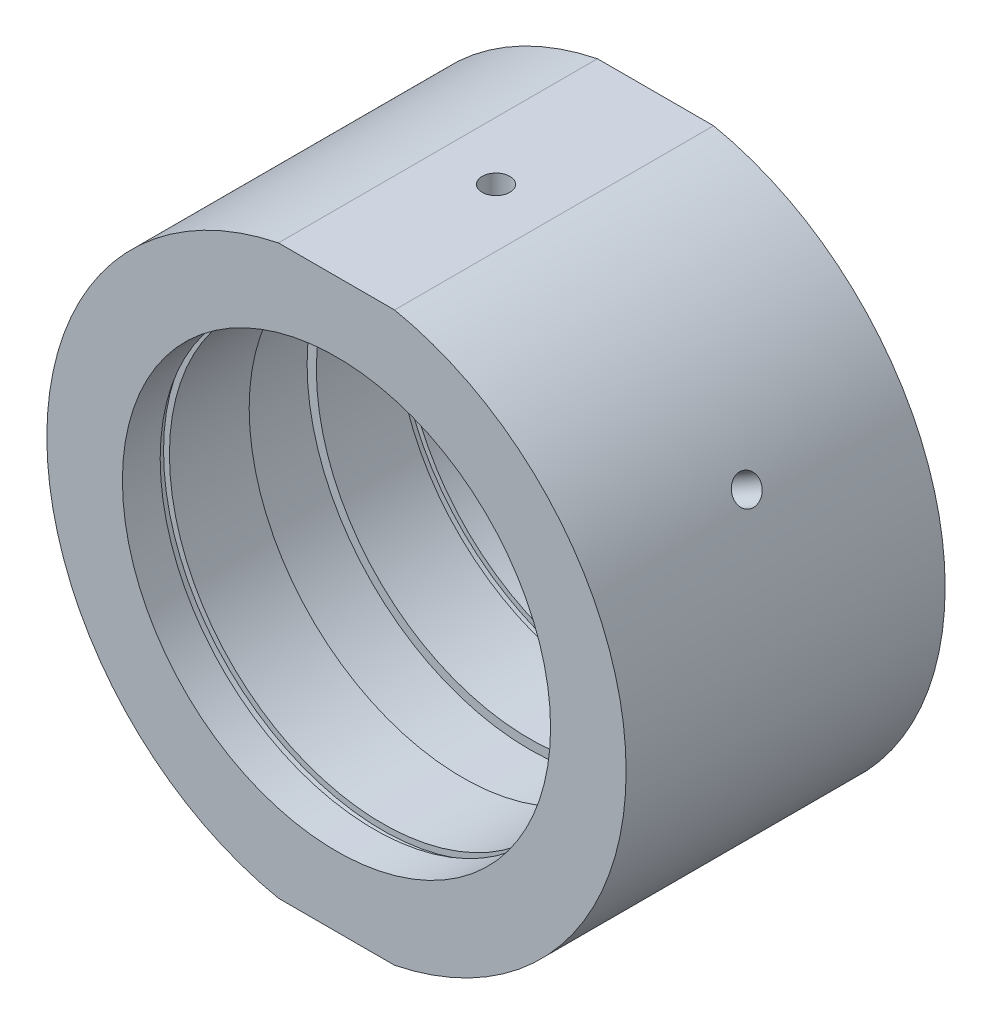
ISO-10303-21;
HEADER;
FILE_DESCRIPTION(('STEP AP214'),'2;1');
FILE_NAME('part.step','',(''),(''),'','','');
FILE_SCHEMA(('AUTOMOTIVE_DESIGN { 1 0 10303 214 1 1 1 1 }'));
ENDSEC;
DATA;
#1=APPLICATION_CONTEXT('core data for automotive mechanical design processes');
#2=APPLICATION_PROTOCOL_DEFINITION('international standard','automotive_design',2000,#1);
#3=PRODUCT_CONTEXT('',#1,'mechanical');
#4=PRODUCT('Part','Part','',(#3));
#5=PRODUCT_RELATED_PRODUCT_CATEGORY('part','',(#4));
#6=PRODUCT_DEFINITION_FORMATION('','',#4);
#7=PRODUCT_DEFINITION_CONTEXT('part definition',#1,'design');
#8=PRODUCT_DEFINITION('design','',#6,#7);
#9=PRODUCT_DEFINITION_SHAPE('','',#8);
#10=(LENGTH_UNIT() NAMED_UNIT(*) SI_UNIT(.MILLI.,.METRE.));
#11=(NAMED_UNIT(*) PLANE_ANGLE_UNIT() SI_UNIT($,.RADIAN.));
#12=(NAMED_UNIT(*) SI_UNIT($,.STERADIAN.) SOLID_ANGLE_UNIT());
#13=UNCERTAINTY_MEASURE_WITH_UNIT(LENGTH_MEASURE(1.E-05),#10,'distance_accuracy_value','');
#14=(GEOMETRIC_REPRESENTATION_CONTEXT(3) GLOBAL_UNCERTAINTY_ASSIGNED_CONTEXT((#13)) GLOBAL_UNIT_ASSIGNED_CONTEXT((#10,
#11,#12)) REPRESENTATION_CONTEXT('',''));
#15=CARTESIAN_POINT('',(0.,0.,0.));
#16=DIRECTION('',(0.,0.,1.));
#17=DIRECTION('',(1.,0.,0.));
#18=AXIS2_PLACEMENT_3D('',#15,#16,#17);
#19=CARTESIAN_POINT('',(0.,0.,-31.9390681003584));
#20=DIRECTION('',(0.,0.,-1.));
#21=DIRECTION('',(-1.,0.,0.));
#22=AXIS2_PLACEMENT_3D('',#19,#20,#21);
#23=CYLINDRICAL_SURFACE('',#22,34.5);
#24=CARTESIAN_POINT('',(29.018686518257,18.659202361171,0.));
#25=CARTESIAN_POINT('',(29.0186890226301,18.6591990847709,-0.0926243427230533));
#26=CARTESIAN_POINT('',(29.0229261660724,18.6526139808489,-0.185314497676535));
#27=CARTESIAN_POINT('',(29.0397421064564,18.6264223952989,-0.368138169659677));
#28=CARTESIAN_POINT('',(29.0523307499622,18.6068005430772,-0.458268537692522));
#29=CARTESIAN_POINT('',(29.0854084283758,18.5550519839002,-0.633297772029717));
#30=CARTESIAN_POINT('',(29.1058934574305,18.5229316173901,-0.718199265666097));
#31=CARTESIAN_POINT('',(29.154053713866,18.4470366758545,-0.880385338206474));
#32=CARTESIAN_POINT('',(29.1817272362996,18.4032648642265,-0.957671717255494));
#33=CARTESIAN_POINT('',(29.2433561506523,18.3051760072346,-1.10252932232191));
#34=CARTESIAN_POINT('',(29.277316671254,18.2508503506647,-1.17009253601071));
#35=CARTESIAN_POINT('',(29.3503804278457,18.1331177240746,-1.29351769255678));
#36=CARTESIAN_POINT('',(29.3894838729624,18.0697103847566,-1.34937915934631));
#37=CARTESIAN_POINT('',(29.4715871030045,17.9354881781567,-1.44783646516308));
#38=CARTESIAN_POINT('',(29.5145886771053,17.8646699070562,-1.49042617247231));
#39=CARTESIAN_POINT('',(29.6031190902553,17.7175816846396,-1.56109160826912));
#40=CARTESIAN_POINT('',(29.648647911373,17.6413117720034,-1.58916743972262));
#41=CARTESIAN_POINT('',(29.740808795372,17.4854932647401,-1.62998728862952));
#42=CARTESIAN_POINT('',(29.7874399787981,17.4059472484999,-1.6427431335627));
#43=CARTESIAN_POINT('',(29.8804691897066,17.2457571173625,-1.65259741342718));
#44=CARTESIAN_POINT('',(29.9268672189013,17.1651130105453,-1.6496959635067));
#45=CARTESIAN_POINT('',(30.018083628711,17.0050913768857,-1.6283278434212));
#46=CARTESIAN_POINT('',(30.0629032703104,16.9257128680339,-1.60987390628149));
#47=CARTESIAN_POINT('',(30.1497956002202,16.770442620803,-1.55794438544301));
#48=CARTESIAN_POINT('',(30.1918682777349,16.6945508961276,-1.52446874271179));
#49=CARTESIAN_POINT('',(30.2722021813879,16.5484360864251,-1.44343152976843));
#50=CARTESIAN_POINT('',(30.3104618277835,16.4782153531619,-1.39586415349126));
#51=CARTESIAN_POINT('',(30.3822123637559,16.3455458494187,-1.28799798254371));
#52=CARTESIAN_POINT('',(30.4157032226793,16.2830971288969,-1.22769910604258));
#53=CARTESIAN_POINT('',(30.4771623434601,16.1677722457299,-1.09600960458675));
#54=CARTESIAN_POINT('',(30.5051250414628,16.114905731566,-1.02460793293809));
#55=CARTESIAN_POINT('',(30.5548550638343,16.0204148604137,-0.872778498215204));
#56=CARTESIAN_POINT('',(30.5766223866588,15.9787905062275,-0.792350732891145));
#57=CARTESIAN_POINT('',(30.6134867225159,15.9080492118723,-0.624745495457385));
#58=CARTESIAN_POINT('',(30.6285835419517,15.8789326347149,-0.537567827532799));
#59=CARTESIAN_POINT('',(30.6517835414348,15.8341026999537,-0.358940446729577));
#60=CARTESIAN_POINT('',(30.6598867696106,15.8183892501122,-0.267490763254709));
#61=CARTESIAN_POINT('',(30.6689247152818,15.8008593470061,-0.0830122772694549));
#62=CARTESIAN_POINT('',(30.6698665258734,15.7990291429491,0.0100148712465112));
#63=CARTESIAN_POINT('',(30.664580676854,15.8092860027456,0.195092849541695));
#64=CARTESIAN_POINT('',(30.658353038901,15.821373024557,0.287143682269393));
#65=CARTESIAN_POINT('',(30.6388634170433,15.8590823818547,0.467612670778403));
#66=CARTESIAN_POINT('',(30.6256046953998,15.8846984401569,0.556032490783883));
#67=CARTESIAN_POINT('',(30.5923358095993,15.9486765040332,0.72678078659425));
#68=CARTESIAN_POINT('',(30.5723256097426,15.987038577004,0.809109230187157));
#69=CARTESIAN_POINT('',(30.5259682580852,16.0753769032314,0.965408887343578));
#70=CARTESIAN_POINT('',(30.4996161301641,16.1253622755297,1.03937347098153));
#71=CARTESIAN_POINT('',(30.4411712398855,16.2354231711368,1.17677914740039));
#72=CARTESIAN_POINT('',(30.4090784437665,16.2954987537871,1.24022017828688));
#73=CARTESIAN_POINT('',(30.3398679677335,16.4239986427153,1.3548297822729));
#74=CARTESIAN_POINT('',(30.3027462394544,16.4924296708247,1.40598837488637));
#75=CARTESIAN_POINT('',(30.2243987545537,16.6355753834692,1.494512673378));
#76=CARTESIAN_POINT('',(30.1831730146581,16.7102900423948,1.53187843546654));
#77=CARTESIAN_POINT('',(30.0976849159111,16.8637798205434,1.5917389330968));
#78=CARTESIAN_POINT('',(30.0534238720324,16.9425531778004,1.6142400640177));
#79=CARTESIAN_POINT('',(29.963030084702,17.1019067894185,1.64375352134685));
#80=CARTESIAN_POINT('',(29.9168973506251,17.1824870347285,1.65076592532464));
#81=CARTESIAN_POINT('',(29.8240946146471,17.3430669653615,1.64910212014318));
#82=CARTESIAN_POINT('',(29.7774251953544,17.4230671501364,1.64044157286201));
#83=CARTESIAN_POINT('',(29.6848591764854,17.5803146476675,1.6077100652785));
#84=CARTESIAN_POINT('',(29.638962578377,17.6575619551951,1.5836390757076));
#85=CARTESIAN_POINT('',(29.5493252013585,17.8071612173229,1.52077310447278));
#86=CARTESIAN_POINT('',(29.5055844419095,17.8795131277338,1.48197798991913));
#87=CARTESIAN_POINT('',(29.4216223362801,18.017343299041,1.39076788234283));
#88=CARTESIAN_POINT('',(29.3814008795705,18.0828217758211,1.33835331726558));
#89=CARTESIAN_POINT('',(29.3057307454963,18.2052007887114,1.22133661715551));
#90=CARTESIAN_POINT('',(29.2702863485369,18.2620936372031,1.15672367477514));
#91=CARTESIAN_POINT('',(29.2053717797418,18.3657292092485,1.01714936462466));
#92=CARTESIAN_POINT('',(29.1759030811655,18.4124694299568,0.942185452546659));
#93=CARTESIAN_POINT('',(29.1239205894126,18.4945835544808,0.783982153805301));
#94=CARTESIAN_POINT('',(29.1014132049216,18.5299469858563,0.700735234302691));
#95=CARTESIAN_POINT('',(29.0641845622712,18.5882862214062,0.528445560311793));
#96=CARTESIAN_POINT('',(29.0494540958738,18.6112766763966,0.439409801080958));
#97=CARTESIAN_POINT('',(29.0321614740973,18.6382333601077,0.291516338342965));
#98=CARTESIAN_POINT('',(29.0271160082175,18.6460874105114,0.233616851804285));
#99=CARTESIAN_POINT('',(29.0203777395267,18.6565729452599,0.117153687562115));
#100=CARTESIAN_POINT('',(29.0186849341027,18.659204433675,0.0585900103763132));
#101=CARTESIAN_POINT('',(29.018686518257,18.659202361171,0.));
#102=B_SPLINE_CURVE_WITH_KNOTS('',3,(#24,#25,#26,#27,#28,#29,#30,#31,#32,#33,#34,#35,#36,#37,
#38,#39,#40,#41,#42,#43,#44,#45,#46,#47,#48,#49,#50,#51,#52,#53,#54,#55,#56,#57,#58,#59,#60,#61,
#62,#63,#64,#65,#66,#67,#68,#69,#70,#71,#72,#73,#74,#75,#76,#77,#78,#79,#80,#81,#82,#83,#84,#85,
#86,#87,#88,#89,#90,#91,#92,#93,#94,#95,#96,#97,#98,#99,#100,#101),.UNSPECIFIED.,.T.,.F.,(4,2,2,
2,2,2,2,2,2,2,2,2,2,2,2,2,2,2,2,2,2,2,2,2,2,2,2,2,2,2,2,2,2,2,2,2,2,2,4),(0.,0.277659154077305,
0.555646256308951,0.83349252028949,1.11127294552115,1.38928097954158,1.6673003216998,
1.94544792246329,2.22359354993492,2.5015243024886,2.77945301106291,3.0571543965571,
3.33485687337425,3.61267392845926,3.89049276924682,4.16858981490659,4.44668692988452,
4.72479211549336,5.00289538721969,5.28072317291099,5.55855011932174,5.8362482730582,
6.11394789519313,6.39186612562733,6.66978599058332,6.94793092956793,7.22607473500656,
7.50409879340258,7.78212145941518,8.05986645258557,8.33761197326971,8.61536000075174,
8.89309930199186,9.17108583548285,9.4491408211698,9.7274510315211,10.0054309661759,
10.1810658470197,10.356700590978),.UNSPECIFIED.);
#103=CARTESIAN_POINT('',(29.018686518257,18.659202361171,0.));
#104=VERTEX_POINT('',#103);
#105=EDGE_CURVE('E11',#104,#104,#102,.T.);
#106=ORIENTED_EDGE('',*,*,#105,.T.);
#107=EDGE_LOOP('',(#106));
#108=FACE_BOUND('',#107,.T.);
#109=CARTESIAN_POINT('',(0.,0.,19.));
#110=DIRECTION('',(0.,0.,-1.));
#111=DIRECTION('',(-1.,0.,0.));
#112=AXIS2_PLACEMENT_3D('',#109,#110,#111);
#113=CIRCLE('',#112,34.5);
#114=CARTESIAN_POINT('',(6.91447756522504,33.8,19.));
#115=VERTEX_POINT('',#114);
#116=CARTESIAN_POINT('',(6.91447756522504,-33.8,19.));
#117=VERTEX_POINT('',#116);
#118=EDGE_CURVE('E169',#115,#117,#113,.T.);
#119=ORIENTED_EDGE('',*,*,#118,.T.);
#120=DIRECTION('',(0.,0.,-1.));
#121=VECTOR('',#120,1.);
#122=CARTESIAN_POINT('',(6.9144775652251,-33.8,-31.9390681003584));
#123=LINE('',#122,#121);
#124=CARTESIAN_POINT('',(6.91447756522504,-33.8,-19.));
#125=VERTEX_POINT('',#124);
#126=EDGE_CURVE('E58',#117,#125,#123,.T.);
#127=ORIENTED_EDGE('',*,*,#126,.T.);
#128=CARTESIAN_POINT('',(0.,0.,-19.));
#129=DIRECTION('',(0.,0.,-1.));
#130=DIRECTION('',(-1.,0.,0.));
#131=AXIS2_PLACEMENT_3D('',#128,#129,#130);
#132=CIRCLE('',#131,34.5);
#133=CARTESIAN_POINT('',(6.9144775652251,33.8,-19.));
#134=VERTEX_POINT('',#133);
#135=EDGE_CURVE('E173',#134,#125,#132,.T.);
#136=ORIENTED_EDGE('',*,*,#135,.F.);
#137=DIRECTION('',(0.,0.,-1.));
#138=VECTOR('',#137,1.);
#139=CARTESIAN_POINT('',(6.9144775652251,33.8,-31.9390681003584));
#140=LINE('',#139,#138);
#141=EDGE_CURVE('E119',#134,#115,#140,.F.);
#142=ORIENTED_EDGE('',*,*,#141,.T.);
#143=EDGE_LOOP('',(#119,#127,#136,#142));
#144=FACE_BOUND('',#143,.T.);
#145=ADVANCED_FACE('F38',(#108,#144),#23,.T.);
#146=CARTESIAN_POINT('',(25.5,0.,-19.));
#147=DIRECTION('',(0.,0.,1.));
#148=DIRECTION('',(1.,0.,0.));
#149=AXIS2_PLACEMENT_3D('',#146,#147,#148);
#150=PLANE('',#149);
#151=CARTESIAN_POINT('',(0.,0.,-19.));
#152=DIRECTION('',(0.,0.,-1.));
#153=DIRECTION('',(-1.,0.,0.));
#154=AXIS2_PLACEMENT_3D('',#151,#152,#153);
#155=CIRCLE('',#154,25.5);
#156=CARTESIAN_POINT('',(-25.5,0.,-19.));
#157=VERTEX_POINT('',#156);
#158=EDGE_CURVE('E127',#157,#157,#155,.T.);
#159=ORIENTED_EDGE('',*,*,#158,.F.);
#160=EDGE_LOOP('',(#159));
#161=FACE_BOUND('',#160,.T.);
#162=ORIENTED_EDGE('',*,*,#135,.T.);
#163=DIRECTION('',(-1.,0.,0.));
#164=VECTOR('',#163,1.);
#165=CARTESIAN_POINT('',(25.5,-33.8,-19.));
#166=LINE('',#165,#164);
#167=CARTESIAN_POINT('',(-6.9144775652251,-33.8,-19.));
#168=VERTEX_POINT('',#167);
#169=EDGE_CURVE('E115',#125,#168,#166,.T.);
#170=ORIENTED_EDGE('',*,*,#169,.T.);
#171=CARTESIAN_POINT('',(-6.91447756522503,33.8,-19.));
#172=VERTEX_POINT('',#171);
#173=EDGE_CURVE('E172',#168,#172,#132,.T.);
#174=ORIENTED_EDGE('',*,*,#173,.T.);
#175=DIRECTION('',(1.,0.,0.));
#176=VECTOR('',#175,1.);
#177=CARTESIAN_POINT('',(25.5,33.8,-19.));
#178=LINE('',#177,#176);
#179=EDGE_CURVE('E122',#172,#134,#178,.T.);
#180=ORIENTED_EDGE('',*,*,#179,.T.);
#181=EDGE_LOOP('',(#162,#170,#174,#180));
#182=FACE_BOUND('',#181,.T.);
#183=ADVANCED_FACE('F40',(#161,#182),#150,.F.);
#184=CARTESIAN_POINT('',(-30.668686518257,15.8013185286824,0.));
#185=CARTESIAN_POINT('',(-30.6686849329979,15.8013223357332,-0.0926243427230536));
#186=CARTESIAN_POINT('',(-30.665100637436,15.8082843615547,-0.185314497676536));
#187=CARTESIAN_POINT('',(-30.6508260291763,15.8359431858907,-0.368138169659678));
#188=CARTESIAN_POINT('',(-30.6401273284359,15.8566561970768,-0.458268537692521));
#189=CARTESIAN_POINT('',(-30.6118506007862,15.9111765864697,-0.633297772029716));
#190=CARTESIAN_POINT('',(-30.5942760619368,15.9449773252833,-0.718199265666097));
#191=CARTESIAN_POINT('',(-30.5526292427661,16.024632801577,-0.880385338206475));
#192=CARTESIAN_POINT('',(-30.5285585031433,16.0704846808308,-0.957671717255495));
#193=CARTESIAN_POINT('',(-30.4744255183365,16.1729013147638,-1.10252932232191));
#194=CARTESIAN_POINT('',(-30.4443583799706,16.2294748166156,-1.17009253601071));
#195=CARTESIAN_POINT('',(-30.3789308127852,16.3516161992149,-1.29351769255678));
#196=CARTESIAN_POINT('',(-30.3435701687077,16.4171844457205,-1.34937915934631));
#197=CARTESIAN_POINT('',(-30.2683819430613,16.5553990319696,-1.44783646516308));
#198=CARTESIAN_POINT('',(-30.2285523082866,16.6280486230939,-1.4904261724723));
#199=CARTESIAN_POINT('',(-30.1454353776513,16.7782623210977,-1.56109160826912));
#200=CARTESIAN_POINT('',(-30.1021481063228,16.855826393108,-1.58916743972262));
#201=CARTESIAN_POINT('',(-30.0132857626524,17.013549313518,-1.62998728862952));
#202=CARTESIAN_POINT('',(-29.9677124835316,17.0937061110937,-1.6427431335627));
#203=CARTESIAN_POINT('',(-29.8754983659854,17.2543668366032,-1.65259741342718));
#204=CARTESIAN_POINT('',(-29.8288575354135,17.3348707619799,-1.6496959635067));
#205=CARTESIAN_POINT('',(-29.735882940414,17.493877306947,-1.6283278434212));
#206=CARTESIAN_POINT('',(-29.6895489560336,17.5723815095864,-1.60987390628149));
#207=CARTESIAN_POINT('',(-29.5985271424346,17.7252675982977,-1.55794438544301));
#208=CARTESIAN_POINT('',(-29.553839319686,17.7996494681684,-1.52446874271179));
#209=CARTESIAN_POINT('',(-29.4674671344411,17.9422780743683,-1.44343152976843));
#210=CARTESIAN_POINT('',(-29.4257840187606,18.0105222667184,-1.39586415349126));
#211=CARTESIAN_POINT('',(-29.3467641261977,18.1389948054771,-1.28799798254371));
#212=CARTESIAN_POINT('',(-29.3094273772536,18.1992231003603,-1.22769910604258));
#213=CARTESIAN_POINT('',(-29.2402826591329,18.3101107018343,-1.09600960458675));
#214=CARTESIAN_POINT('',(-29.2084802638588,18.3607603657449,-1.02460793293809));
#215=CARTESIAN_POINT('',(-29.151513780201,18.4510732640255,-0.872778498215205));
#216=CARTESIAN_POINT('',(-29.1263496934718,18.490736495657,-0.792350732891147));
#217=CARTESIAN_POINT('',(-29.0835181033921,18.5580325941805,-0.624745495457386));
#218=CARTESIAN_POINT('',(-29.0658508176205,18.585665111907,-0.537567827532799));
#219=CARTESIAN_POINT('',(-29.0386269550089,18.6281718682077,-0.358940446729576));
#220=CARTESIAN_POINT('',(-29.0290703223529,18.6430461945814,-0.267490763254708));
#221=CARTESIAN_POINT('',(-29.0184079537728,18.6596382366837,-0.083012277269454));
#222=CARTESIAN_POINT('',(-29.0172938558611,18.6613689706101,0.0100148712465125));
#223=CARTESIAN_POINT('',(-29.0235336324983,18.6516628611804,0.195092849541697));
#224=CARTESIAN_POINT('',(-29.0308874814665,18.6402260576018,0.287143682269394));
#225=CARTESIAN_POINT('',(-29.0537999319178,18.6044928713141,0.467612670778405));
#226=CARTESIAN_POINT('',(-29.0693547283306,18.5802024523981,0.556032490783886));
#227=CARTESIAN_POINT('',(-29.1081269140322,18.519401720201,0.726780786594252));
#228=CARTESIAN_POINT('',(-29.1313443438384,18.482891342305,0.809109230187159));
#229=CARTESIAN_POINT('',(-29.1846689026504,18.3985755350037,0.965408887343579));
#230=CARTESIAN_POINT('',(-29.2147814409179,18.3507612366312,1.03937347098153));
#231=CARTESIAN_POINT('',(-29.2808745273376,18.245116029125,1.17677914740039));
#232=CARTESIAN_POINT('',(-29.3168551100003,18.1872850610823,1.24022017828688));
#233=CARTESIAN_POINT('',(-29.3935340401792,18.0630970861656,1.3548297822729));
#234=CARTESIAN_POINT('',(-29.4342361847895,17.9967332123888,1.40598837488637));
#235=CARTESIAN_POINT('',(-29.519030265932,17.8573094438199,1.494512673378));
#236=CARTESIAN_POINT('',(-29.5631221886489,17.7842495763177,1.53187843546654));
#237=CARTESIAN_POINT('',(-29.6533041863734,17.6334698220073,1.5917389330968));
#238=CARTESIAN_POINT('',(-29.6993933929599,17.5557519549819,1.6142400640177));
#239=CARTESIAN_POINT('',(-29.7922007751408,17.3977918330003,1.64375352134685));
#240=CARTESIAN_POINT('',(-29.838918947584,17.3175495906887,1.65076592532464));
#241=CARTESIAN_POINT('',(-29.9315838788611,17.1568900984746,1.64910212014318));
#242=CARTESIAN_POINT('',(-29.9775313615373,17.0764731033998,1.64044157286201));
#243=CARTESIAN_POINT('',(-30.0674286796463,16.9176848307665,1.6077100652785));
#244=CARTESIAN_POINT('',(-30.1113785112849,16.8393135570935,1.5836390757076));
#245=CARTESIAN_POINT('',(-30.1961165841658,16.686885680403,1.52077310447278));
#246=CARTESIAN_POINT('',(-30.2369047968694,16.6128291163339,1.48197798991912));
#247=CARTESIAN_POINT('',(-30.3142881738147,16.47120071425,1.39076788234282));
#248=CARTESIAN_POINT('',(-30.3508834697526,16.4036286725723,1.33835331726558));
#249=CARTESIAN_POINT('',(-30.4190317367686,16.276906907711,1.22133661715551));
#250=CARTESIAN_POINT('',(-30.4505801903763,16.2177647352765,1.15672367477514));
#251=CARTESIAN_POINT('',(-30.5078739441058,16.1097292836016,1.01714936462466));
#252=CARTESIAN_POINT('',(-30.5336178133295,16.0608385316639,0.942185452546657));
#253=CARTESIAN_POINT('',(-30.5787394853004,15.9747633109919,0.783982153805299));
#254=CARTESIAN_POINT('',(-30.5981114229911,15.9375896285622,0.700735234302688));
#255=CARTESIAN_POINT('',(-30.6300203616894,15.8761790605036,0.528445560311791));
#256=CARTESIAN_POINT('',(-30.642565446557,15.8519268748986,0.439409801080957));
#257=CARTESIAN_POINT('',(-30.6572643085644,15.8234726832866,0.291516338342964));
#258=CARTESIAN_POINT('',(-30.6615433827967,15.8151761564589,0.233616851804285));
#259=CARTESIAN_POINT('',(-30.6672549879157,15.8040978772209,0.117153687562115));
#260=CARTESIAN_POINT('',(-30.668687521021,15.8013161205125,0.0585900103763133));
#261=CARTESIAN_POINT('',(-30.668686518257,15.8013185286824,0.));
#262=B_SPLINE_CURVE_WITH_KNOTS('',3,(#184,#185,#186,#187,#188,#189,#190,#191,#192,#193,#194,
#195,#196,#197,#198,#199,#200,#201,#202,#203,#204,#205,#206,#207,#208,#209,#210,#211,#212,#213,
#214,#215,#216,#217,#218,#219,#220,#221,#222,#223,#224,#225,#226,#227,#228,#229,#230,#231,#232,
#233,#234,#235,#236,#237,#238,#239,#240,#241,#242,#243,#244,#245,#246,#247,#248,#249,#250,#251,
#252,#253,#254,#255,#256,#257,#258,#259,#260,#261),.UNSPECIFIED.,.T.,.F.,(4,2,2,2,2,2,2,2,2,2,2,
2,2,2,2,2,2,2,2,2,2,2,2,2,2,2,2,2,2,2,2,2,2,2,2,2,2,2,4),(0.,0.277659154077306,
0.555646256308952,0.833492520289487,1.11127294552115,1.38928097954158,1.6673003216998,
1.94544792246328,2.22359354993492,2.5015243024886,2.77945301106292,3.0571543965571,
3.33485687337425,3.61267392845926,3.89049276924682,4.16858981490659,4.44668692988452,
4.72479211549336,5.00289538721969,5.28072317291099,5.55855011932174,5.8362482730582,
6.11394789519314,6.39186612562733,6.66978599058333,6.94793092956793,7.22607473500657,
7.50409879340259,7.78212145941519,8.05986645258557,8.33761197326972,8.61536000075175,
8.89309930199186,9.17108583548285,9.44914082116981,9.7274510315211,10.0054309661759,
10.1810658470197,10.356700590978),.UNSPECIFIED.);
#263=CARTESIAN_POINT('',(-30.668686518257,15.8013185286824,0.));
#264=VERTEX_POINT('',#263);
#265=EDGE_CURVE('E197',#264,#264,#262,.T.);
#266=ORIENTED_EDGE('',*,*,#265,.T.);
#267=EDGE_LOOP('',(#266));
#268=FACE_BOUND('',#267,.T.);
#269=ORIENTED_EDGE('',*,*,#173,.F.);
#270=DIRECTION('',(0.,0.,-1.));
#271=VECTOR('',#270,1.);
#272=CARTESIAN_POINT('',(-6.9144775652251,-33.8,-31.9390681003584));
#273=LINE('',#272,#271);
#274=CARTESIAN_POINT('',(-6.91447756522503,-33.8,19.));
#275=VERTEX_POINT('',#274);
#276=EDGE_CURVE('E113',#168,#275,#273,.F.);
#277=ORIENTED_EDGE('',*,*,#276,.T.);
#278=CARTESIAN_POINT('',(-6.91447756522503,33.8,19.));
#279=VERTEX_POINT('',#278);
#280=EDGE_CURVE('E66',#275,#279,#113,.T.);
#281=ORIENTED_EDGE('',*,*,#280,.T.);
#282=DIRECTION('',(0.,0.,-1.));
#283=VECTOR('',#282,1.);
#284=CARTESIAN_POINT('',(-6.9144775652251,33.8,-31.9390681003584));
#285=LINE('',#284,#283);
#286=EDGE_CURVE('E125',#279,#172,#285,.T.);
#287=ORIENTED_EDGE('',*,*,#286,.T.);
#288=EDGE_LOOP('',(#269,#277,#281,#287));
#289=FACE_BOUND('',#288,.T.);
#290=ADVANCED_FACE('F182',(#268,#289),#23,.T.);
#291=CARTESIAN_POINT('',(34.5,0.,19.));
#292=DIRECTION('',(0.,0.,-1.));
#293=DIRECTION('',(-1.,0.,0.));
#294=AXIS2_PLACEMENT_3D('',#291,#292,#293);
#295=PLANE('',#294);
#296=ORIENTED_EDGE('',*,*,#280,.F.);
#297=DIRECTION('',(1.,0.,0.));
#298=VECTOR('',#297,1.);
#299=CARTESIAN_POINT('',(34.5,-33.8,19.));
#300=LINE('',#299,#298);
#301=EDGE_CURVE('E51',#275,#117,#300,.T.);
#302=ORIENTED_EDGE('',*,*,#301,.T.);
#303=ORIENTED_EDGE('',*,*,#118,.F.);
#304=DIRECTION('',(-1.,0.,0.));
#305=VECTOR('',#304,1.);
#306=CARTESIAN_POINT('',(34.5,33.8,19.));
#307=LINE('',#306,#305);
#308=EDGE_CURVE('E176',#115,#279,#307,.T.);
#309=ORIENTED_EDGE('',*,*,#308,.T.);
#310=EDGE_LOOP('',(#296,#302,#303,#309));
#311=FACE_BOUND('',#310,.T.);
#312=CARTESIAN_POINT('',(0.,0.,19.));
#313=DIRECTION('',(0.,0.,-1.));
#314=DIRECTION('',(-1.,0.,0.));
#315=AXIS2_PLACEMENT_3D('',#312,#313,#314);
#316=CIRCLE('',#315,25.5);
#317=CARTESIAN_POINT('',(-25.5,0.,19.));
#318=VERTEX_POINT('',#317);
#319=EDGE_CURVE('E166',#318,#318,#316,.T.);
#320=ORIENTED_EDGE('',*,*,#319,.T.);
#321=EDGE_LOOP('',(#320));
#322=FACE_BOUND('',#321,.T.);
#323=ADVANCED_FACE('F231',(#311,#322),#295,.F.);
#324=CARTESIAN_POINT('',(0.,0.,-31.9390681003584));
#325=DIRECTION('',(0.,0.,-1.));
#326=DIRECTION('',(-1.,0.,0.));
#327=AXIS2_PLACEMENT_3D('',#324,#325,#326);
#328=CYLINDRICAL_SURFACE('',#327,25.5);
#329=ORIENTED_EDGE('',*,*,#319,.F.);
#330=EDGE_LOOP('',(#329));
#331=FACE_BOUND('',#330,.T.);
#332=CARTESIAN_POINT('',(0.,0.,14.5));
#333=DIRECTION('',(0.,0.,-1.));
#334=DIRECTION('',(-1.,0.,0.));
#335=AXIS2_PLACEMENT_3D('',#332,#333,#334);
#336=CIRCLE('',#335,25.5);
#337=CARTESIAN_POINT('',(-25.5,0.,14.5));
#338=VERTEX_POINT('',#337);
#339=EDGE_CURVE('E163',#338,#338,#336,.T.);
#340=ORIENTED_EDGE('',*,*,#339,.T.);
#341=EDGE_LOOP('',(#340));
#342=FACE_BOUND('',#341,.T.);
#343=ADVANCED_FACE('F228',(#331,#342),#328,.F.);
#344=CARTESIAN_POINT('',(25.5,0.,14.5));
#345=DIRECTION('',(0.,0.,1.));
#346=DIRECTION('',(1.,0.,0.));
#347=AXIS2_PLACEMENT_3D('',#344,#345,#346);
#348=PLANE('',#347);
#349=ORIENTED_EDGE('',*,*,#339,.F.);
#350=EDGE_LOOP('',(#349));
#351=FACE_BOUND('',#350,.T.);
#352=CARTESIAN_POINT('',(0.,0.,14.5));
#353=DIRECTION('',(0.,0.,-1.));
#354=DIRECTION('',(-1.,0.,0.));
#355=AXIS2_PLACEMENT_3D('',#352,#353,#354);
#356=CIRCLE('',#355,26.1);
#357=CARTESIAN_POINT('',(-26.1,0.,14.5));
#358=VERTEX_POINT('',#357);
#359=EDGE_CURVE('E160',#358,#358,#356,.T.);
#360=ORIENTED_EDGE('',*,*,#359,.T.);
#361=EDGE_LOOP('',(#360));
#362=FACE_BOUND('',#361,.T.);
#363=ADVANCED_FACE('F224',(#351,#362),#348,.F.);
#364=CARTESIAN_POINT('',(0.,0.,-31.9390681003584));
#365=DIRECTION('',(0.,0.,-1.));
#366=DIRECTION('',(-1.,0.,0.));
#367=AXIS2_PLACEMENT_3D('',#364,#365,#366);
#368=CYLINDRICAL_SURFACE('',#367,26.1);
#369=ORIENTED_EDGE('',*,*,#359,.F.);
#370=EDGE_LOOP('',(#369));
#371=FACE_BOUND('',#370,.T.);
#372=CARTESIAN_POINT('',(0.,0.,13.5));
#373=DIRECTION('',(0.,0.,-1.));
#374=DIRECTION('',(-1.,0.,0.));
#375=AXIS2_PLACEMENT_3D('',#372,#373,#374);
#376=CIRCLE('',#375,26.1);
#377=CARTESIAN_POINT('',(-26.1,0.,13.5));
#378=VERTEX_POINT('',#377);
#379=EDGE_CURVE('E157',#378,#378,#376,.T.);
#380=ORIENTED_EDGE('',*,*,#379,.T.);
#381=EDGE_LOOP('',(#380));
#382=FACE_BOUND('',#381,.T.);
#383=ADVANCED_FACE('F220',(#371,#382),#368,.F.);
#384=CARTESIAN_POINT('',(26.1,0.,13.5));
#385=DIRECTION('',(0.,0.,-1.));
#386=DIRECTION('',(-1.,0.,0.));
#387=AXIS2_PLACEMENT_3D('',#384,#385,#386);
#388=PLANE('',#387);
#389=ORIENTED_EDGE('',*,*,#379,.F.);
#390=EDGE_LOOP('',(#389));
#391=FACE_BOUND('',#390,.T.);
#392=CARTESIAN_POINT('',(0.,0.,13.5));
#393=DIRECTION('',(0.,0.,-1.));
#394=DIRECTION('',(-1.,0.,0.));
#395=AXIS2_PLACEMENT_3D('',#392,#393,#394);
#396=CIRCLE('',#395,25.4);
#397=CARTESIAN_POINT('',(-25.4,0.,13.5));
#398=VERTEX_POINT('',#397);
#399=EDGE_CURVE('E154',#398,#398,#396,.T.);
#400=ORIENTED_EDGE('',*,*,#399,.T.);
#401=EDGE_LOOP('',(#400));
#402=FACE_BOUND('',#401,.T.);
#403=ADVANCED_FACE('F216',(#391,#402),#388,.F.);
#404=CARTESIAN_POINT('',(0.,0.,-31.9390681003584));
#405=DIRECTION('',(0.,0.,-1.));
#406=DIRECTION('',(-1.,0.,0.));
#407=AXIS2_PLACEMENT_3D('',#404,#405,#406);
#408=CYLINDRICAL_SURFACE('',#407,25.4);
#409=ORIENTED_EDGE('',*,*,#399,.F.);
#410=EDGE_LOOP('',(#409));
#411=FACE_BOUND('',#410,.T.);
#412=CARTESIAN_POINT('',(0.,0.,4.));
#413=DIRECTION('',(0.,0.,-1.));
#414=DIRECTION('',(-1.,0.,0.));
#415=AXIS2_PLACEMENT_3D('',#412,#413,#414);
#416=CIRCLE('',#415,25.4);
#417=CARTESIAN_POINT('',(-25.4,0.,4.));
#418=VERTEX_POINT('',#417);
#419=EDGE_CURVE('E151',#418,#418,#416,.T.);
#420=ORIENTED_EDGE('',*,*,#419,.T.);
#421=EDGE_LOOP('',(#420));
#422=FACE_BOUND('',#421,.T.);
#423=ADVANCED_FACE('F212',(#411,#422),#408,.F.);
#424=CARTESIAN_POINT('',(25.4,0.,4.));
#425=DIRECTION('',(0.,0.,1.));
#426=DIRECTION('',(1.,0.,0.));
#427=AXIS2_PLACEMENT_3D('',#424,#425,#426);
#428=PLANE('',#427);
#429=ORIENTED_EDGE('',*,*,#419,.F.);
#430=EDGE_LOOP('',(#429));
#431=FACE_BOUND('',#430,.T.);
#432=CARTESIAN_POINT('',(0.,0.,4.));
#433=DIRECTION('',(0.,0.,-1.));
#434=DIRECTION('',(-1.,0.,0.));
#435=AXIS2_PLACEMENT_3D('',#432,#433,#434);
#436=CIRCLE('',#435,26.5);
#437=CARTESIAN_POINT('',(-26.5,0.,4.));
#438=VERTEX_POINT('',#437);
#439=EDGE_CURVE('E148',#438,#438,#436,.T.);
#440=ORIENTED_EDGE('',*,*,#439,.T.);
#441=EDGE_LOOP('',(#440));
#442=FACE_BOUND('',#441,.T.);
#443=ADVANCED_FACE('F206',(#431,#442),#428,.F.);
#444=CARTESIAN_POINT('',(0.,0.,-31.9390681003584));
#445=DIRECTION('',(0.,0.,-1.));
#446=DIRECTION('',(-1.,0.,0.));
#447=AXIS2_PLACEMENT_3D('',#444,#445,#446);
#448=CYLINDRICAL_SURFACE('',#447,26.5);
#449=CARTESIAN_POINT('',(-23.7301440728933,11.7953491800679,0.));
#450=CARTESIAN_POINT('',(-23.7301426315556,11.7953530523703,0.0925847942911662));
#451=CARTESIAN_POINT('',(-23.7266601850363,11.8023662019751,0.185234434036178));
#452=CARTESIAN_POINT('',(-23.7127829671561,11.8302221765848,0.367975476334142));
#453=CARTESIAN_POINT('',(-23.7023801480403,11.8510811028887,0.458063772945839));
#454=CARTESIAN_POINT('',(-23.6748577267139,11.9059669326837,0.633008646244695));
#455=CARTESIAN_POINT('',(-23.6577416673841,11.9399868903737,0.717867955216655));
#456=CARTESIAN_POINT('',(-23.6171248265298,12.0201257551922,0.879978001386833));
#457=CARTESIAN_POINT('',(-23.593625507895,12.0662418900844,0.957230476368435));
#458=CARTESIAN_POINT('',(-23.5406732430841,12.1692255333633,1.10207147063525));
#459=CARTESIAN_POINT('',(-23.5112125003349,12.226107114835,1.16964713451791));
#460=CARTESIAN_POINT('',(-23.4469742856686,12.3488535927227,1.29310627919577));
#461=CARTESIAN_POINT('',(-23.4121965921936,12.414718863478,1.34898927252585));
#462=CARTESIAN_POINT('',(-23.3380723141613,12.5535080894395,1.44751591371275));
#463=CARTESIAN_POINT('',(-23.2987221137363,12.6264376232677,1.49014898449409));
#464=CARTESIAN_POINT('',(-23.2164163184041,12.7771427669188,1.56089784694351));
#465=CARTESIAN_POINT('',(-23.1734607618567,12.8549183251792,1.58901379304684));
#466=CARTESIAN_POINT('',(-23.0851004064078,13.0129288729823,1.62989479118302));
#467=CARTESIAN_POINT('',(-23.0396988875959,13.0931605094179,1.64267989191114));
#468=CARTESIAN_POINT('',(-22.9476290832938,13.2538633471374,1.65259818878884));
#469=CARTESIAN_POINT('',(-22.9009608119979,13.3343345457279,1.64973156024639));
#470=CARTESIAN_POINT('',(-22.8077641476428,13.4931227056173,1.62844431441806));
#471=CARTESIAN_POINT('',(-22.7612356503592,13.5714424986272,1.61004526468086));
#472=CARTESIAN_POINT('',(-22.6696546839537,13.7238721805026,1.558248925697));
#473=CARTESIAN_POINT('',(-22.6246022235062,13.7979820446288,1.52485154832424));
#474=CARTESIAN_POINT('',(-22.5373586689691,13.9400295705033,1.44398215830166));
#475=CARTESIAN_POINT('',(-22.495169587228,14.0079629026162,1.39650037061728));
#476=CARTESIAN_POINT('',(-22.4150636715141,14.1357921533411,1.28881710743125));
#477=CARTESIAN_POINT('',(-22.3771468852504,14.195687982199,1.22861548990752));
#478=CARTESIAN_POINT('',(-22.3068044837855,14.3059696905885,1.09707965852733));
#479=CARTESIAN_POINT('',(-22.2743882968894,14.3563392582196,1.02572672486742));
#480=CARTESIAN_POINT('',(-22.2162551565766,14.4461371128321,0.873979299454731));
#481=CARTESIAN_POINT('',(-22.1905382058045,14.4855653954942,0.793584804132693));
#482=CARTESIAN_POINT('',(-22.1467214540453,14.5524683853247,0.626024399450549));
#483=CARTESIAN_POINT('',(-22.128622078978,14.5799424241009,0.538858111783454));
#484=CARTESIAN_POINT('',(-22.1007034178629,14.6222281477467,0.360233938984281));
#485=CARTESIAN_POINT('',(-22.0908840351472,14.6370399804462,0.268776103968694));
#486=CARTESIAN_POINT('',(-22.0798976561406,14.6536077552007,0.0843293304343462));
#487=CARTESIAN_POINT('',(-22.078716165179,14.6553855687891,-0.00865678060556187));
#488=CARTESIAN_POINT('',(-22.0850110524289,14.6458976499179,-0.193665030605217));
#489=CARTESIAN_POINT('',(-22.0924873859348,14.6346319848099,-0.285687174540048));
#490=CARTESIAN_POINT('',(-22.1158120738629,14.5993595127735,-0.466081269376436));
#491=CARTESIAN_POINT('',(-22.1316537946875,14.5753628012591,-0.554456052784433));
#492=CARTESIAN_POINT('',(-22.1711272970583,14.5152471536344,-0.725134211646602));
#493=CARTESIAN_POINT('',(-22.1947591487193,14.4791281084173,-0.807437532446506));
#494=CARTESIAN_POINT('',(-22.2490032692352,14.395635650197,-0.963756774418125));
#495=CARTESIAN_POINT('',(-22.2796247907633,14.3482473158054,-1.03776151482473));
#496=CARTESIAN_POINT('',(-22.3467583289334,14.2434635399753,-1.17527024430645));
#497=CARTESIAN_POINT('',(-22.3832704028358,14.1860680012593,-1.23877413129366));
#498=CARTESIAN_POINT('',(-22.4609956798557,14.0626806345092,-1.35356695943021));
#499=CARTESIAN_POINT('',(-22.5022152894159,13.9966770741436,-1.40483895421078));
#500=CARTESIAN_POINT('',(-22.5879512261451,13.8578895820082,-1.49359661128041));
#501=CARTESIAN_POINT('',(-22.6324675331025,13.7851056918069,-1.53108235808248));
#502=CARTESIAN_POINT('',(-22.723343035635,13.6347857679719,-1.59117395772099));
#503=CARTESIAN_POINT('',(-22.7697008769134,13.557253204665,-1.61379053838447));
#504=CARTESIAN_POINT('',(-22.8628702689887,13.3995353765926,-1.64353691282089));
#505=CARTESIAN_POINT('',(-22.9096818153571,13.3193501377005,-1.65066685760017));
#506=CARTESIAN_POINT('',(-23.0023133002366,13.1587295609621,-1.64923610076408));
#507=CARTESIAN_POINT('',(-23.0481347822393,13.078294875659,-1.64070192178828));
#508=CARTESIAN_POINT('',(-23.1376056669382,12.9193469243502,-1.6082401582113));
#509=CARTESIAN_POINT('',(-23.1812550658089,12.8408336617286,-1.5843125465011));
#510=CARTESIAN_POINT('',(-23.2652506332778,12.6880148893639,-1.52174910253589));
#511=CARTESIAN_POINT('',(-23.3055968241629,12.6137093512321,-1.48311336952718));
#512=CARTESIAN_POINT('',(-23.3820073356233,12.471497800057,-1.39223412672861));
#513=CARTESIAN_POINT('',(-23.4180717676544,12.4035916204455,-1.33999097125807));
#514=CARTESIAN_POINT('',(-23.4851556451101,12.276101617329,-1.2232819695849));
#515=CARTESIAN_POINT('',(-23.5161670427244,12.2165310906591,-1.15879697303644));
#516=CARTESIAN_POINT('',(-23.5724206276007,12.107632023832,-1.0194600512231));
#517=CARTESIAN_POINT('',(-23.5976614009239,12.058305994088,-0.944605592395897));
#518=CARTESIAN_POINT('',(-23.641880226511,11.9713778751013,-0.786569577280321));
#519=CARTESIAN_POINT('',(-23.6608505041558,11.9337903432686,-0.70337784905865));
#520=CARTESIAN_POINT('',(-23.6921006658618,11.8716295340132,-0.531163071026294));
#521=CARTESIAN_POINT('',(-23.7043883877379,11.8470410113032,-0.442146990408106));
#522=CARTESIAN_POINT('',(-23.7188548568036,11.8180401128949,-0.293821780690323));
#523=CARTESIAN_POINT('',(-23.723084457187,11.8095429473751,-0.235471469666116));
#524=CARTESIAN_POINT('',(-23.72872952299,11.7981962498272,-0.118089566805455));
#525=CARTESIAN_POINT('',(-23.7301449922936,11.7953467100042,-0.0590579759094221));
#526=CARTESIAN_POINT('',(-23.7301440728933,11.7953491800679,0.));
#527=B_SPLINE_CURVE_WITH_KNOTS('',3,(#449,#450,#451,#452,#453,#454,#455,#456,#457,#458,#459,
#460,#461,#462,#463,#464,#465,#466,#467,#468,#469,#470,#471,#472,#473,#474,#475,#476,#477,#478,
#479,#480,#481,#482,#483,#484,#485,#486,#487,#488,#489,#490,#491,#492,#493,#494,#495,#496,#497,
#498,#499,#500,#501,#502,#503,#504,#505,#506,#507,#508,#509,#510,#511,#512,#513,#514,#515,#516,
#517,#518,#519,#520,#521,#522,#523,#524,#525,#526),.UNSPECIFIED.,.T.,.F.,(4,2,2,2,2,2,2,2,2,2,2,
2,2,2,2,2,2,2,2,2,2,2,2,2,2,2,2,2,2,2,2,2,2,2,2,2,2,2,4),(0.,0.277538784680575,
0.555400886890089,0.833116545573364,1.11076861211985,1.38878617702621,1.66681533012119,
1.945065860092,2.22331342993284,2.50119672724163,2.77907691211106,3.05657187980647,
3.33406847800807,3.61175812020916,3.88945086309182,4.16761487994958,4.44577900661578,
4.72395868414412,5.00213511391119,5.27984464697352,5.55755274605553,5.83504095771687,
6.1125316669748,6.39039186090516,6.66825475599719,6.94650040233518,7.22474434293232,
7.50278731475136,7.78082757542993,8.0583974899899,8.33596789337319,8.61353642382187,
8.89109772747496,9.16909686241467,9.44716404085246,9.72557470526545,10.0036581201336,
10.1806947664638,10.3577311684463),.UNSPECIFIED.);
#528=CARTESIAN_POINT('',(-23.7301440728933,11.7953491800679,0.));
#529=VERTEX_POINT('',#528);
#530=EDGE_CURVE('E42',#529,#529,#527,.T.);
#531=ORIENTED_EDGE('',*,*,#530,.T.);
#532=EDGE_LOOP('',(#531));
#533=FACE_BOUND('',#532,.T.);
#534=CARTESIAN_POINT('',(22.0801440728932,14.6532330125565,0.));
#535=CARTESIAN_POINT('',(22.0801467057366,14.6532298281703,0.0925847942911664));
#536=CARTESIAN_POINT('',(22.0844790481953,14.6467073662148,0.185234434036179));
#537=CARTESIAN_POINT('',(22.1016644209144,14.620761355692,0.367975476334142));
#538=CARTESIAN_POINT('',(22.1145273714313,14.6013227869147,0.45806377294584));
#539=CARTESIAN_POINT('',(22.1482986836784,14.5500447559749,0.633008646244696));
#540=CARTESIAN_POINT('',(22.1692028016087,14.5182118349376,0.717867955216656));
#541=CARTESIAN_POINT('',(22.2182966739448,14.4429671865271,0.879978001386834));
#542=CARTESIAN_POINT('',(22.2464847589684,14.3995581121716,0.957230476368436));
#543=CARTESIAN_POINT('',(22.3091950778168,14.302208284018,1.10207147063525));
#544=CARTESIAN_POINT('',(22.3437256010041,14.248253741647,1.16964713451791));
#545=CARTESIAN_POINT('',(22.4179080617468,14.1312485769084,1.29310627919577));
#546=CARTESIAN_POINT('',(22.4575602127105,14.0681975754963,1.34898927252585));
#547=CARTESIAN_POINT('',(22.5406930691485,13.9346094547024,1.44751591371275));
#548=CARTESIAN_POINT('',(22.5841767979175,13.8640664145763,1.49014898449409));
#549=CARTESIAN_POINT('',(22.6735383831342,13.7174349331143,1.56089784694351));
#550=CARTESIAN_POINT('',(22.7194162141075,13.6413465507804,1.58901379304684));
#551=CARTESIAN_POINT('',(22.8120771848465,13.4858189643727,1.62989479118302));
#552=CARTESIAN_POINT('',(22.8588590607809,13.4063842774934,1.64267989191114));
#553=CARTESIAN_POINT('',(22.9519968985552,13.2462980691866,1.65259818878884));
#554=CARTESIAN_POINT('',(22.9983528651596,13.1656465613983,1.64973156024639));
#555=CARTESIAN_POINT('',(23.0892691132665,13.0055418025742,1.62844431441806));
#556=CARTESIAN_POINT('',(23.1338317949904,12.9260870454218,1.61004526468086));
#557=CARTESIAN_POINT('',(23.2200492885825,12.7705607610737,1.558248925697));
#558=CARTESIAN_POINT('',(23.261704083363,12.6944892537601,1.52485154832424));
#559=CARTESIAN_POINT('',(23.3410990720466,12.5479103562772,1.44398215830166));
#560=CARTESIAN_POINT('',(23.3788365225495,12.4774068736706,1.39650037061728));
#561=CARTESIAN_POINT('',(23.4494869431671,12.3441184903065,1.28881710743125));
#562=CARTESIAN_POINT('',(23.4823998594069,12.2813336757434,1.22861548990752));
#563=CARTESIAN_POINT('',(23.5427354197125,12.1652745149168,1.09707965852733));
#564=CARTESIAN_POINT('',(23.5701486514107,12.1120164897555,1.02572672486742));
#565=CARTESIAN_POINT('',(23.618849304554,12.0167727861366,0.873979299454731));
#566=CARTESIAN_POINT('',(23.6401367235809,11.9747871121289,0.793584804132693));
#567=CARTESIAN_POINT('',(23.6761680364836,11.9033891970789,0.626024399450547));
#568=CARTESIAN_POINT('',(23.6909115644747,11.8739776590899,0.538858111783452));
#569=CARTESIAN_POINT('',(23.7135727448119,11.8286565275017,0.360233938984279));
#570=CARTESIAN_POINT('',(23.7214904768484,11.8127467762707,0.268776103968693));
#571=CARTESIAN_POINT('',(23.7303454011667,11.7949484055781,0.0843293304343453));
#572=CARTESIAN_POINT('',(23.7312942874166,11.7930362975968,-0.00865678060556301));
#573=CARTESIAN_POINT('',(23.72622495227,11.8032317893049,-0.193665030605218));
#574=CARTESIAN_POINT('',(23.7202067668489,11.8153393166021,-0.285687174540049));
#575=CARTESIAN_POINT('',(23.7013222539752,11.8531753249013,-0.466081269376437));
#576=CARTESIAN_POINT('',(23.6884613526087,11.8788930133324,-0.554456052784435));
#577=CARTESIAN_POINT('',(23.6561364257862,11.9431358929741,-0.725134211646603));
#578=CARTESIAN_POINT('',(23.6366723408982,11.9816611994596,-0.807437532446508));
#579=CARTESIAN_POINT('',(23.591487811313,12.0703842149424,-0.963756774418125));
#580=CARTESIAN_POINT('',(23.5657590706509,12.1205973976841,-1.03776151482473));
#581=CARTESIAN_POINT('',(23.5085804279626,12.2311286351004,-1.17527024430645));
#582=CARTESIAN_POINT('',(23.4771304703219,12.2914467880027,-1.23877413129366));
#583=CARTESIAN_POINT('',(23.4091365147202,12.4204525357932,-1.35356695943021));
#584=CARTESIAN_POINT('',(23.3725855594835,12.4891515449892,-1.40483895421077));
#585=CARTESIAN_POINT('',(23.2952600339313,12.6327947902816,-1.49359661128041));
#586=CARTESIAN_POINT('',(23.2544854895094,12.7077389880901,-1.53108235808248));
#587=CARTESIAN_POINT('',(23.1697423680395,12.8615994437824,-1.59117395772099));
#588=CARTESIAN_POINT('',(23.1257761192344,12.9405127936476,-1.61379053838447));
#589=CARTESIAN_POINT('',(23.0357731695317,13.1000587680761,-1.64353691282089));
#590=CARTESIAN_POINT('',(22.9897364888268,13.1806913758676,-1.65066685760017));
#591=CARTESIAN_POINT('',(22.8969507314406,13.3412228833327,-1.64923610076408));
#592=CARTESIAN_POINT('',(22.8502029916241,13.4211227934377,-1.64070192178828));
#593=CARTESIAN_POINT('',(22.7572854702606,13.5780808281404,-1.6082401582113));
#594=CARTESIAN_POINT('',(22.7111156897316,13.6551389477331,-1.5843125465011));
#595=CARTESIAN_POINT('',(22.6207685344231,13.8042906291489,-1.52174910253589));
#596=CARTESIAN_POINT('',(22.5765911462016,13.8763842244672,-1.48311336952718));
#597=CARTESIAN_POINT('',(22.4916375859026,14.0136634440956,-1.39223412672861));
#598=CARTESIAN_POINT('',(22.4508613253007,14.0788492482133,-1.33999097125807));
#599=CARTESIAN_POINT('',(22.373993682601,14.2006905918326,-1.22328196958489));
#600=CARTESIAN_POINT('',(22.3379097919953,14.2573325133084,-1.15879697303644));
#601=CARTESIAN_POINT('',(22.2717272261128,14.3604990802787,-1.0194600512231));
#602=CARTESIAN_POINT('',(22.2416300179482,14.4070212460598,-0.944605592395895));
#603=CARTESIAN_POINT('',(22.188457471396,14.4887799318371,-0.786569577280319));
#604=CARTESIAN_POINT('',(22.1653908527858,14.5240024401107,-0.703377849058648));
#605=CARTESIAN_POINT('',(22.1271830937039,14.5821462786482,-0.531163071026293));
#606=CARTESIAN_POINT('',(22.1120326693334,14.6050820193025,-0.442146990408105));
#607=CARTESIAN_POINT('',(22.0941503891121,14.6321107982206,-0.293821780690323));
#608=CARTESIAN_POINT('',(22.0889064281036,14.6400223223604,-0.235471469666116));
#609=CARTESIAN_POINT('',(22.0819024326795,14.6505844415257,-0.118089566805454));
#610=CARTESIAN_POINT('',(22.0801423934555,14.6532350438124,-0.0590579759094218));
#611=CARTESIAN_POINT('',(22.0801440728932,14.6532330125565,0.));
#612=B_SPLINE_CURVE_WITH_KNOTS('',3,(#534,#535,#536,#537,#538,#539,#540,#541,#542,#543,#544,
#545,#546,#547,#548,#549,#550,#551,#552,#553,#554,#555,#556,#557,#558,#559,#560,#561,#562,#563,
#564,#565,#566,#567,#568,#569,#570,#571,#572,#573,#574,#575,#576,#577,#578,#579,#580,#581,#582,
#583,#584,#585,#586,#587,#588,#589,#590,#591,#592,#593,#594,#595,#596,#597,#598,#599,#600,#601,
#602,#603,#604,#605,#606,#607,#608,#609,#610,#611),.UNSPECIFIED.,.T.,.F.,(4,2,2,2,2,2,2,2,2,2,2,
2,2,2,2,2,2,2,2,2,2,2,2,2,2,2,2,2,2,2,2,2,2,2,2,2,2,2,4),(0.,0.277538784680576,0.55540088689009,
0.833116545573365,1.11076861211985,1.38878617702621,1.66681533012119,1.94506586009201,
2.22331342993285,2.50119672724163,2.77907691211106,3.05657187980647,3.33406847800807,
3.61175812020916,3.88945086309182,4.16761487994958,4.44577900661579,4.72395868414413,
5.0021351139112,5.27984464697352,5.55755274605554,5.83504095771688,6.1125316669748,
6.39039186090516,6.66825475599719,6.94650040233518,7.22474434293232,7.50278731475136,
7.78082757542993,8.05839748998991,8.3359678933732,8.61353642382187,8.89109772747496,
9.16909686241467,9.44716404085246,9.72557470526545,10.0036581201336,10.1806947664638,
10.3577311684463),.UNSPECIFIED.);
#613=CARTESIAN_POINT('',(22.0801440728932,14.6532330125565,0.));
#614=VERTEX_POINT('',#613);
#615=EDGE_CURVE('E107',#614,#614,#612,.T.);
#616=ORIENTED_EDGE('',*,*,#615,.T.);
#617=EDGE_LOOP('',(#616));
#618=FACE_BOUND('',#617,.T.);
#619=ORIENTED_EDGE('',*,*,#439,.F.);
#620=EDGE_LOOP('',(#619));
#621=FACE_BOUND('',#620,.T.);
#622=CARTESIAN_POINT('',(0.,0.,-4.));
#623=DIRECTION('',(0.,0.,-1.));
#624=DIRECTION('',(-1.,0.,0.));
#625=AXIS2_PLACEMENT_3D('',#622,#623,#624);
#626=CIRCLE('',#625,26.5);
#627=CARTESIAN_POINT('',(-26.5,0.,-4.));
#628=VERTEX_POINT('',#627);
#629=EDGE_CURVE('E145',#628,#628,#626,.T.);
#630=ORIENTED_EDGE('',*,*,#629,.T.);
#631=EDGE_LOOP('',(#630));
#632=FACE_BOUND('',#631,.T.);
#633=ADVANCED_FACE('F200',(#533,#618,#621,#632),#448,.F.);
#634=CARTESIAN_POINT('',(26.5,0.,-4.));
#635=DIRECTION('',(0.,0.,-1.));
#636=DIRECTION('',(-1.,0.,0.));
#637=AXIS2_PLACEMENT_3D('',#634,#635,#636);
#638=PLANE('',#637);
#639=ORIENTED_EDGE('',*,*,#629,.F.);
#640=EDGE_LOOP('',(#639));
#641=FACE_BOUND('',#640,.T.);
#642=CARTESIAN_POINT('',(0.,0.,-4.));
#643=DIRECTION('',(0.,0.,-1.));
#644=DIRECTION('',(-1.,0.,0.));
#645=AXIS2_PLACEMENT_3D('',#642,#643,#644);
#646=CIRCLE('',#645,25.4);
#647=CARTESIAN_POINT('',(-25.4,0.,-4.));
#648=VERTEX_POINT('',#647);
#649=EDGE_CURVE('E142',#648,#648,#646,.T.);
#650=ORIENTED_EDGE('',*,*,#649,.T.);
#651=EDGE_LOOP('',(#650));
#652=FACE_BOUND('',#651,.T.);
#653=ADVANCED_FACE('F205',(#641,#652),#638,.F.);
#654=CARTESIAN_POINT('',(0.,0.,-31.9390681003584));
#655=DIRECTION('',(0.,0.,-1.));
#656=DIRECTION('',(-1.,0.,0.));
#657=AXIS2_PLACEMENT_3D('',#654,#655,#656);
#658=CYLINDRICAL_SURFACE('',#657,25.4);
#659=ORIENTED_EDGE('',*,*,#649,.F.);
#660=EDGE_LOOP('',(#659));
#661=FACE_BOUND('',#660,.T.);
#662=CARTESIAN_POINT('',(0.,0.,-13.5));
#663=DIRECTION('',(0.,0.,-1.));
#664=DIRECTION('',(-1.,0.,0.));
#665=AXIS2_PLACEMENT_3D('',#662,#663,#664);
#666=CIRCLE('',#665,25.4);
#667=CARTESIAN_POINT('',(-25.4,0.,-13.5));
#668=VERTEX_POINT('',#667);
#669=EDGE_CURVE('E139',#668,#668,#666,.T.);
#670=ORIENTED_EDGE('',*,*,#669,.T.);
#671=EDGE_LOOP('',(#670));
#672=FACE_BOUND('',#671,.T.);
#673=ADVANCED_FACE('F286',(#661,#672),#658,.F.);
#674=CARTESIAN_POINT('',(25.4,0.,-13.5));
#675=DIRECTION('',(0.,0.,1.));
#676=DIRECTION('',(1.,0.,0.));
#677=AXIS2_PLACEMENT_3D('',#674,#675,#676);
#678=PLANE('',#677);
#679=ORIENTED_EDGE('',*,*,#669,.F.);
#680=EDGE_LOOP('',(#679));
#681=FACE_BOUND('',#680,.T.);
#682=CARTESIAN_POINT('',(0.,0.,-13.5));
#683=DIRECTION('',(0.,0.,-1.));
#684=DIRECTION('',(-1.,0.,0.));
#685=AXIS2_PLACEMENT_3D('',#682,#683,#684);
#686=CIRCLE('',#685,26.1);
#687=CARTESIAN_POINT('',(-26.1,0.,-13.5));
#688=VERTEX_POINT('',#687);
#689=EDGE_CURVE('E136',#688,#688,#686,.T.);
#690=ORIENTED_EDGE('',*,*,#689,.T.);
#691=EDGE_LOOP('',(#690));
#692=FACE_BOUND('',#691,.T.);
#693=ADVANCED_FACE('F283',(#681,#692),#678,.F.);
#694=CARTESIAN_POINT('',(0.,0.,-31.9390681003584));
#695=DIRECTION('',(0.,0.,-1.));
#696=DIRECTION('',(-1.,0.,0.));
#697=AXIS2_PLACEMENT_3D('',#694,#695,#696);
#698=CYLINDRICAL_SURFACE('',#697,26.1);
#699=ORIENTED_EDGE('',*,*,#689,.F.);
#700=EDGE_LOOP('',(#699));
#701=FACE_BOUND('',#700,.T.);
#702=CARTESIAN_POINT('',(0.,0.,-14.5));
#703=DIRECTION('',(0.,0.,-1.));
#704=DIRECTION('',(-1.,0.,0.));
#705=AXIS2_PLACEMENT_3D('',#702,#703,#704);
#706=CIRCLE('',#705,26.1);
#707=CARTESIAN_POINT('',(-26.1,0.,-14.5));
#708=VERTEX_POINT('',#707);
#709=EDGE_CURVE('E133',#708,#708,#706,.T.);
#710=ORIENTED_EDGE('',*,*,#709,.T.);
#711=EDGE_LOOP('',(#710));
#712=FACE_BOUND('',#711,.T.);
#713=ADVANCED_FACE('F279',(#701,#712),#698,.F.);
#714=CARTESIAN_POINT('',(26.1,0.,-14.5));
#715=DIRECTION('',(0.,0.,-1.));
#716=DIRECTION('',(-1.,0.,0.));
#717=AXIS2_PLACEMENT_3D('',#714,#715,#716);
#718=PLANE('',#717);
#719=ORIENTED_EDGE('',*,*,#709,.F.);
#720=EDGE_LOOP('',(#719));
#721=FACE_BOUND('',#720,.T.);
#722=CARTESIAN_POINT('',(0.,0.,-14.5));
#723=DIRECTION('',(0.,0.,-1.));
#724=DIRECTION('',(-1.,0.,0.));
#725=AXIS2_PLACEMENT_3D('',#722,#723,#724);
#726=CIRCLE('',#725,25.5);
#727=CARTESIAN_POINT('',(-25.5,0.,-14.5));
#728=VERTEX_POINT('',#727);
#729=EDGE_CURVE('E130',#728,#728,#726,.T.);
#730=ORIENTED_EDGE('',*,*,#729,.T.);
#731=EDGE_LOOP('',(#730));
#732=FACE_BOUND('',#731,.T.);
#733=ADVANCED_FACE('F271',(#721,#732),#718,.F.);
#734=CARTESIAN_POINT('',(0.,0.,-31.9390681003584));
#735=DIRECTION('',(0.,0.,-1.));
#736=DIRECTION('',(-1.,0.,0.));
#737=AXIS2_PLACEMENT_3D('',#734,#735,#736);
#738=CYLINDRICAL_SURFACE('',#737,25.5);
#739=ORIENTED_EDGE('',*,*,#729,.F.);
#740=EDGE_LOOP('',(#739));
#741=FACE_BOUND('',#740,.T.);
#742=ORIENTED_EDGE('',*,*,#158,.T.);
#743=EDGE_LOOP('',(#742));
#744=FACE_BOUND('',#743,.T.);
#745=ADVANCED_FACE('F260',(#741,#744),#738,.F.);
#746=CARTESIAN_POINT('',(-33.1519726534682,33.8,-30.));
#747=DIRECTION('',(0.,-1.,0.));
#748=DIRECTION('',(0.,0.,-1.));
#749=AXIS2_PLACEMENT_3D('',#746,#747,#748);
#750=PLANE('',#749);
#751=CARTESIAN_POINT('',(0.,33.8,0.));
#752=DIRECTION('',(0.,1.,0.));
#753=DIRECTION('',(0.,0.,1.));
#754=AXIS2_PLACEMENT_3D('',#751,#752,#753);
#755=CIRCLE('',#754,1.64999999999999);
#756=CARTESIAN_POINT('',(0.,33.8,1.64999999999999));
#757=VERTEX_POINT('',#756);
#758=EDGE_CURVE('E100',#757,#757,#755,.T.);
#759=ORIENTED_EDGE('',*,*,#758,.F.);
#760=EDGE_LOOP('',(#759));
#761=FACE_BOUND('',#760,.T.);
#762=ORIENTED_EDGE('',*,*,#308,.F.);
#763=ORIENTED_EDGE('',*,*,#141,.F.);
#764=ORIENTED_EDGE('',*,*,#179,.F.);
#765=ORIENTED_EDGE('',*,*,#286,.F.);
#766=EDGE_LOOP('',(#762,#763,#764,#765));
#767=FACE_BOUND('',#766,.T.);
#768=ADVANCED_FACE('F258',(#761,#767),#750,.F.);
#769=CARTESIAN_POINT('',(-33.1519726534682,-33.8,-30.));
#770=DIRECTION('',(0.,1.,0.));
#771=DIRECTION('',(0.,0.,1.));
#772=AXIS2_PLACEMENT_3D('',#769,#770,#771);
#773=PLANE('',#772);
#774=CARTESIAN_POINT('',(0.,-33.8,0.));
#775=DIRECTION('',(0.,-1.,0.));
#776=DIRECTION('',(0.,0.,-1.));
#777=AXIS2_PLACEMENT_3D('',#774,#775,#776);
#778=CIRCLE('',#777,2.5);
#779=CARTESIAN_POINT('',(0.,-33.8,-2.5));
#780=VERTEX_POINT('',#779);
#781=EDGE_CURVE('E101',#780,#780,#778,.T.);
#782=ORIENTED_EDGE('',*,*,#781,.F.);
#783=EDGE_LOOP('',(#782));
#784=FACE_BOUND('',#783,.T.);
#785=ORIENTED_EDGE('',*,*,#301,.F.);
#786=ORIENTED_EDGE('',*,*,#276,.F.);
#787=ORIENTED_EDGE('',*,*,#169,.F.);
#788=ORIENTED_EDGE('',*,*,#126,.F.);
#789=EDGE_LOOP('',(#785,#786,#787,#788));
#790=FACE_BOUND('',#789,.T.);
#791=ADVANCED_FACE('F253',(#784,#790),#773,.F.);
#792=CARTESIAN_POINT('',(0.,28.3,0.));
#793=DIRECTION('',(0.,1.,0.));
#794=DIRECTION('',(0.,0.,1.));
#795=AXIS2_PLACEMENT_3D('',#792,#793,#794);
#796=CONICAL_SURFACE('',#795,1.65,1.02974425867665);
#797=CARTESIAN_POINT('',(0.,27.3085799786045,0.));
#798=VERTEX_POINT('',#797);
#799=VERTEX_LOOP('',#798);
#800=FACE_BOUND('',#799,.T.);
#801=CARTESIAN_POINT('',(0.,28.3,0.));
#802=DIRECTION('',(0.,1.,0.));
#803=DIRECTION('',(0.,0.,1.));
#804=AXIS2_PLACEMENT_3D('',#801,#802,#803);
#805=CIRCLE('',#804,1.65);
#806=CARTESIAN_POINT('',(0.,28.3,1.65));
#807=VERTEX_POINT('',#806);
#808=EDGE_CURVE('E104',#807,#807,#805,.T.);
#809=ORIENTED_EDGE('',*,*,#808,.T.);
#810=EDGE_LOOP('',(#809));
#811=FACE_BOUND('',#810,.T.);
#812=ADVANCED_FACE('F267',(#800,#811),#796,.F.);
#813=CARTESIAN_POINT('',(0.,33.8,0.));
#814=DIRECTION('',(0.,1.,0.));
#815=DIRECTION('',(0.,0.,1.));
#816=AXIS2_PLACEMENT_3D('',#813,#814,#815);
#817=CYLINDRICAL_SURFACE('',#816,1.64999999999999);
#818=ORIENTED_EDGE('',*,*,#808,.F.);
#819=EDGE_LOOP('',(#818));
#820=FACE_BOUND('',#819,.T.);
#821=ORIENTED_EDGE('',*,*,#758,.T.);
#822=EDGE_LOOP('',(#821));
#823=FACE_BOUND('',#822,.T.);
#824=ADVANCED_FACE('F94',(#820,#823),#817,.F.);
#825=CARTESIAN_POINT('',(0.,-28.3,0.));
#826=DIRECTION('',(0.,-1.,0.));
#827=DIRECTION('',(0.,0.,-1.));
#828=AXIS2_PLACEMENT_3D('',#825,#826,#827);
#829=CONICAL_SURFACE('',#828,2.5,1.02974425867665);
#830=CARTESIAN_POINT('',(0.,-26.7978484524311,0.));
#831=VERTEX_POINT('',#830);
#832=VERTEX_LOOP('',#831);
#833=FACE_BOUND('',#832,.T.);
#834=CARTESIAN_POINT('',(0.,-28.3,0.));
#835=DIRECTION('',(0.,-1.,0.));
#836=DIRECTION('',(0.,0.,-1.));
#837=AXIS2_PLACEMENT_3D('',#834,#835,#836);
#838=CIRCLE('',#837,2.5);
#839=CARTESIAN_POINT('',(0.,-28.3,-2.5));
#840=VERTEX_POINT('',#839);
#841=EDGE_CURVE('E98',#840,#840,#838,.T.);
#842=ORIENTED_EDGE('',*,*,#841,.T.);
#843=EDGE_LOOP('',(#842));
#844=FACE_BOUND('',#843,.T.);
#845=ADVANCED_FACE('F90',(#833,#844),#829,.F.);
#846=CARTESIAN_POINT('',(0.,-33.8,0.));
#847=DIRECTION('',(0.,-1.,0.));
#848=DIRECTION('',(0.,0.,-1.));
#849=AXIS2_PLACEMENT_3D('',#846,#847,#848);
#850=CYLINDRICAL_SURFACE('',#849,2.5);
#851=ORIENTED_EDGE('',*,*,#841,.F.);
#852=EDGE_LOOP('',(#851));
#853=FACE_BOUND('',#852,.T.);
#854=ORIENTED_EDGE('',*,*,#781,.T.);
#855=EDGE_LOOP('',(#854));
#856=FACE_BOUND('',#855,.T.);
#857=ADVANCED_FACE('F93',(#853,#856),#850,.F.);
#858=CARTESIAN_POINT('',(29.8778764305631,17.2500000000001,0.));
#859=DIRECTION('',(0.866025403784436,0.500000000000004,0.));
#860=DIRECTION('',(-0.500000000000004,0.866025403784436,0.));
#861=AXIS2_PLACEMENT_3D('',#858,#859,#860);
#862=CYLINDRICAL_SURFACE('',#861,1.64999999999999);
#863=ORIENTED_EDGE('',*,*,#105,.F.);
#864=EDGE_LOOP('',(#863));
#865=FACE_BOUND('',#864,.T.);
#866=ORIENTED_EDGE('',*,*,#615,.F.);
#867=EDGE_LOOP('',(#866));
#868=FACE_BOUND('',#867,.T.);
#869=ADVANCED_FACE('F185',(#865,#868),#862,.F.);
#870=CARTESIAN_POINT('',(-29.8778764305631,17.2500000000001,0.));
#871=DIRECTION('',(-0.866025403784436,0.500000000000004,0.));
#872=DIRECTION('',(-0.500000000000004,-0.866025403784436,0.));
#873=AXIS2_PLACEMENT_3D('',#870,#871,#872);
#874=CYLINDRICAL_SURFACE('',#873,1.64999999999999);
#875=ORIENTED_EDGE('',*,*,#530,.F.);
#876=EDGE_LOOP('',(#875));
#877=FACE_BOUND('',#876,.T.);
#878=ORIENTED_EDGE('',*,*,#265,.F.);
#879=EDGE_LOOP('',(#878));
#880=FACE_BOUND('',#879,.T.);
#881=ADVANCED_FACE('F189',(#877,#880),#874,.F.);
#882=CLOSED_SHELL('',(#145,#183,#290,#323,#343,#363,#383,#403,#423,#443,#633,#653,#673,#693,
#713,#733,#745,#768,#791,#812,#824,#845,#857,#869,#881));
#883=MANIFOLD_SOLID_BREP('B2',#882);
#884=ADVANCED_BREP_SHAPE_REPRESENTATION('',(#18,#883),#14);
#885=SHAPE_DEFINITION_REPRESENTATION(#9,#884);
ENDSEC;
END-ISO-10303-21;
